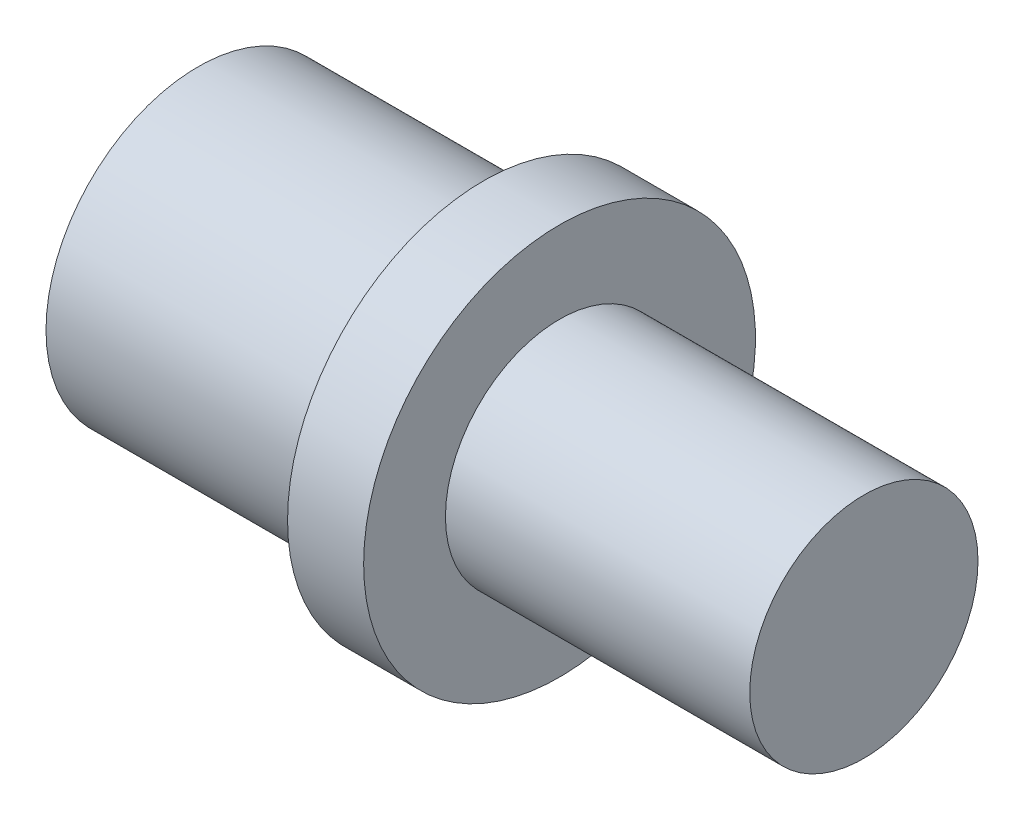
ISO-10303-21;
HEADER;
FILE_DESCRIPTION(('STEP AP214'),'2;1');
FILE_NAME('part.step','',(''),(''),'','','');
FILE_SCHEMA(('AUTOMOTIVE_DESIGN { 1 0 10303 214 1 1 1 1 }'));
ENDSEC;
DATA;
#1=APPLICATION_CONTEXT('core data for automotive mechanical design processes');
#2=APPLICATION_PROTOCOL_DEFINITION('international standard','automotive_design',2000,#1);
#3=PRODUCT_CONTEXT('',#1,'mechanical');
#4=PRODUCT('Part','Part','',(#3));
#5=PRODUCT_RELATED_PRODUCT_CATEGORY('part','',(#4));
#6=PRODUCT_DEFINITION_FORMATION('','',#4);
#7=PRODUCT_DEFINITION_CONTEXT('part definition',#1,'design');
#8=PRODUCT_DEFINITION('design','',#6,#7);
#9=PRODUCT_DEFINITION_SHAPE('','',#8);
#10=(LENGTH_UNIT() NAMED_UNIT(*) SI_UNIT(.MILLI.,.METRE.));
#11=(NAMED_UNIT(*) PLANE_ANGLE_UNIT() SI_UNIT($,.RADIAN.));
#12=(NAMED_UNIT(*) SI_UNIT($,.STERADIAN.) SOLID_ANGLE_UNIT());
#13=UNCERTAINTY_MEASURE_WITH_UNIT(LENGTH_MEASURE(1.E-05),#10,'distance_accuracy_value','');
#14=(GEOMETRIC_REPRESENTATION_CONTEXT(3) GLOBAL_UNCERTAINTY_ASSIGNED_CONTEXT((#13)) GLOBAL_UNIT_ASSIGNED_CONTEXT((#10,
#11,#12)) REPRESENTATION_CONTEXT('',''));
#15=CARTESIAN_POINT('',(0.,0.,0.));
#16=DIRECTION('',(0.,0.,1.));
#17=DIRECTION('',(1.,0.,0.));
#18=AXIS2_PLACEMENT_3D('',#15,#16,#17);
#19=CARTESIAN_POINT('',(-9.5,3.2,0.));
#20=DIRECTION('',(1.,0.,0.));
#21=DIRECTION('',(0.,0.,-1.));
#22=AXIS2_PLACEMENT_3D('',#19,#20,#21);
#23=PLANE('',#22);
#24=CARTESIAN_POINT('',(-9.5,0.,0.));
#25=DIRECTION('',(-1.,0.,0.));
#26=DIRECTION('',(0.,0.,1.));
#27=AXIS2_PLACEMENT_3D('',#24,#25,#26);
#28=CIRCLE('',#27,3.2);
#29=CARTESIAN_POINT('',(-9.5,0.,3.2));
#30=VERTEX_POINT('',#29);
#31=EDGE_CURVE('E150',#30,#30,#28,.T.);
#32=ORIENTED_EDGE('',*,*,#31,.T.);
#33=EDGE_LOOP('',(#32));
#34=FACE_BOUND('',#33,.T.);
#35=DIRECTION('',(0.,-1.,0.));
#36=VECTOR('',#35,1.);
#37=CARTESIAN_POINT('',(-9.5,1.44337567297406,2.5));
#38=LINE('',#37,#36);
#39=CARTESIAN_POINT('',(-9.5,1.44337567297406,2.5));
#40=VERTEX_POINT('',#39);
#41=CARTESIAN_POINT('',(-9.5,-1.44337567297406,2.5));
#42=VERTEX_POINT('',#41);
#43=EDGE_CURVE('E281',#40,#42,#38,.T.);
#44=ORIENTED_EDGE('',*,*,#43,.T.);
#45=DIRECTION('',(0.,-0.5,-0.866025403784439));
#46=VECTOR('',#45,1.);
#47=CARTESIAN_POINT('',(-9.5,-1.44337567297406,2.5));
#48=LINE('',#47,#46);
#49=CARTESIAN_POINT('',(-9.5,-2.88675134594813,0.));
#50=VERTEX_POINT('',#49);
#51=EDGE_CURVE('E283',#42,#50,#48,.T.);
#52=ORIENTED_EDGE('',*,*,#51,.T.);
#53=DIRECTION('',(0.,0.5,-0.866025403784439));
#54=VECTOR('',#53,1.);
#55=CARTESIAN_POINT('',(-9.5,-2.88675134594813,0.));
#56=LINE('',#55,#54);
#57=CARTESIAN_POINT('',(-9.5,-1.44337567297406,-2.5));
#58=VERTEX_POINT('',#57);
#59=EDGE_CURVE('E285',#50,#58,#56,.T.);
#60=ORIENTED_EDGE('',*,*,#59,.T.);
#61=DIRECTION('',(0.,1.,0.));
#62=VECTOR('',#61,1.);
#63=CARTESIAN_POINT('',(-9.5,-1.44337567297406,-2.5));
#64=LINE('',#63,#62);
#65=CARTESIAN_POINT('',(-9.5,1.44337567297407,-2.5));
#66=VERTEX_POINT('',#65);
#67=EDGE_CURVE('E122',#58,#66,#64,.T.);
#68=ORIENTED_EDGE('',*,*,#67,.T.);
#69=DIRECTION('',(0.,0.5,0.866025403784439));
#70=VECTOR('',#69,1.);
#71=CARTESIAN_POINT('',(-9.5,1.44337567297407,-2.5));
#72=LINE('',#71,#70);
#73=CARTESIAN_POINT('',(-9.5,2.88675134594813,0.));
#74=VERTEX_POINT('',#73);
#75=EDGE_CURVE('E278',#66,#74,#72,.T.);
#76=ORIENTED_EDGE('',*,*,#75,.T.);
#77=DIRECTION('',(0.,-0.5,0.866025403784439));
#78=VECTOR('',#77,1.);
#79=CARTESIAN_POINT('',(-9.5,2.88675134594813,0.));
#80=LINE('',#79,#78);
#81=EDGE_CURVE('E137',#74,#40,#80,.T.);
#82=ORIENTED_EDGE('',*,*,#81,.T.);
#83=EDGE_LOOP('',(#44,#52,#60,#68,#76,#82));
#84=FACE_BOUND('',#83,.T.);
#85=ADVANCED_FACE('F39',(#34,#84),#23,.F.);
#86=CARTESIAN_POINT('',(8.,0.,0.));
#87=DIRECTION('',(-1.,0.,0.));
#88=DIRECTION('',(0.,0.,1.));
#89=AXIS2_PLACEMENT_3D('',#86,#87,#88);
#90=PLANE('',#89);
#91=CARTESIAN_POINT('',(8.,0.,0.));
#92=DIRECTION('',(-1.,0.,0.));
#93=DIRECTION('',(0.,0.,1.));
#94=AXIS2_PLACEMENT_3D('',#91,#92,#93);
#95=CIRCLE('',#94,3.);
#96=CARTESIAN_POINT('',(8.,0.,3.));
#97=VERTEX_POINT('',#96);
#98=EDGE_CURVE('E11',#97,#97,#95,.T.);
#99=ORIENTED_EDGE('',*,*,#98,.F.);
#100=EDGE_LOOP('',(#99));
#101=FACE_BOUND('',#100,.T.);
#102=ADVANCED_FACE('F176',(#101),#90,.F.);
#103=CARTESIAN_POINT('',(-9.19047979429519,0.,0.));
#104=DIRECTION('',(-1.,0.,0.));
#105=DIRECTION('',(0.,0.,1.));
#106=AXIS2_PLACEMENT_3D('',#103,#104,#105);
#107=CYLINDRICAL_SURFACE('',#106,3.);
#108=CARTESIAN_POINT('',(0.,0.,0.));
#109=DIRECTION('',(-1.,0.,0.));
#110=DIRECTION('',(0.,0.,1.));
#111=AXIS2_PLACEMENT_3D('',#108,#109,#110);
#112=CIRCLE('',#111,3.);
#113=CARTESIAN_POINT('',(0.,0.,3.));
#114=VERTEX_POINT('',#113);
#115=EDGE_CURVE('E46',#114,#114,#112,.T.);
#116=ORIENTED_EDGE('',*,*,#115,.F.);
#117=EDGE_LOOP('',(#116));
#118=FACE_BOUND('',#117,.T.);
#119=ORIENTED_EDGE('',*,*,#98,.T.);
#120=EDGE_LOOP('',(#119));
#121=FACE_BOUND('',#120,.T.);
#122=ADVANCED_FACE('F173',(#118,#121),#107,.T.);
#123=CARTESIAN_POINT('',(0.,3.,0.));
#124=DIRECTION('',(-1.,0.,0.));
#125=DIRECTION('',(0.,0.,1.));
#126=AXIS2_PLACEMENT_3D('',#123,#124,#125);
#127=PLANE('',#126);
#128=CARTESIAN_POINT('',(0.,0.,0.));
#129=DIRECTION('',(-1.,0.,0.));
#130=DIRECTION('',(0.,0.,1.));
#131=AXIS2_PLACEMENT_3D('',#128,#129,#130);
#132=CIRCLE('',#131,5.15);
#133=CARTESIAN_POINT('',(0.,0.,5.15));
#134=VERTEX_POINT('',#133);
#135=EDGE_CURVE('E166',#134,#134,#132,.T.);
#136=ORIENTED_EDGE('',*,*,#135,.F.);
#137=EDGE_LOOP('',(#136));
#138=FACE_BOUND('',#137,.T.);
#139=ORIENTED_EDGE('',*,*,#115,.T.);
#140=EDGE_LOOP('',(#139));
#141=FACE_BOUND('',#140,.T.);
#142=ADVANCED_FACE('F171',(#138,#141),#127,.F.);
#143=CARTESIAN_POINT('',(-9.19047979429519,0.,0.));
#144=DIRECTION('',(-1.,0.,0.));
#145=DIRECTION('',(0.,0.,1.));
#146=AXIS2_PLACEMENT_3D('',#143,#144,#145);
#147=CYLINDRICAL_SURFACE('',#146,5.15);
#148=CARTESIAN_POINT('',(-2.,0.,0.));
#149=DIRECTION('',(-1.,0.,0.));
#150=DIRECTION('',(0.,0.,1.));
#151=AXIS2_PLACEMENT_3D('',#148,#149,#150);
#152=CIRCLE('',#151,5.15);
#153=CARTESIAN_POINT('',(-2.,0.,5.15));
#154=VERTEX_POINT('',#153);
#155=EDGE_CURVE('E163',#154,#154,#152,.T.);
#156=ORIENTED_EDGE('',*,*,#155,.F.);
#157=EDGE_LOOP('',(#156));
#158=FACE_BOUND('',#157,.T.);
#159=ORIENTED_EDGE('',*,*,#135,.T.);
#160=EDGE_LOOP('',(#159));
#161=FACE_BOUND('',#160,.T.);
#162=ADVANCED_FACE('F188',(#158,#161),#147,.T.);
#163=CARTESIAN_POINT('',(-2.,5.15,0.));
#164=DIRECTION('',(1.,0.,0.));
#165=DIRECTION('',(0.,0.,-1.));
#166=AXIS2_PLACEMENT_3D('',#163,#164,#165);
#167=PLANE('',#166);
#168=CARTESIAN_POINT('',(-2.,0.,0.));
#169=DIRECTION('',(-1.,0.,0.));
#170=DIRECTION('',(0.,0.,1.));
#171=AXIS2_PLACEMENT_3D('',#168,#169,#170);
#172=CIRCLE('',#171,4.);
#173=CARTESIAN_POINT('',(-2.,0.,4.));
#174=VERTEX_POINT('',#173);
#175=EDGE_CURVE('E160',#174,#174,#172,.T.);
#176=ORIENTED_EDGE('',*,*,#175,.F.);
#177=EDGE_LOOP('',(#176));
#178=FACE_BOUND('',#177,.T.);
#179=ORIENTED_EDGE('',*,*,#155,.T.);
#180=EDGE_LOOP('',(#179));
#181=FACE_BOUND('',#180,.T.);
#182=ADVANCED_FACE('F192',(#178,#181),#167,.F.);
#183=CARTESIAN_POINT('',(-9.19047979429519,0.,0.));
#184=DIRECTION('',(-1.,0.,0.));
#185=DIRECTION('',(0.,0.,1.));
#186=AXIS2_PLACEMENT_3D('',#183,#184,#185);
#187=CYLINDRICAL_SURFACE('',#186,4.);
#188=CARTESIAN_POINT('',(-9.5,0.,0.));
#189=DIRECTION('',(-1.,0.,0.));
#190=DIRECTION('',(0.,0.,1.));
#191=AXIS2_PLACEMENT_3D('',#188,#189,#190);
#192=CIRCLE('',#191,4.);
#193=CARTESIAN_POINT('',(-9.5,0.,4.));
#194=VERTEX_POINT('',#193);
#195=EDGE_CURVE('E157',#194,#194,#192,.T.);
#196=ORIENTED_EDGE('',*,*,#195,.F.);
#197=EDGE_LOOP('',(#196));
#198=FACE_BOUND('',#197,.T.);
#199=ORIENTED_EDGE('',*,*,#175,.T.);
#200=EDGE_LOOP('',(#199));
#201=FACE_BOUND('',#200,.T.);
#202=ADVANCED_FACE('F196',(#198,#201),#187,.T.);
#203=CARTESIAN_POINT('',(-9.5,0.,0.));
#204=DIRECTION('',(-1.,0.,0.));
#205=DIRECTION('',(0.,0.,1.));
#206=AXIS2_PLACEMENT_3D('',#203,#204,#205);
#207=CONICAL_SURFACE('',#206,4.,1.01219701145133);
#208=CARTESIAN_POINT('',(-9.,0.,0.));
#209=DIRECTION('',(-1.,0.,0.));
#210=DIRECTION('',(0.,0.,1.));
#211=AXIS2_PLACEMENT_3D('',#208,#209,#210);
#212=CIRCLE('',#211,3.2);
#213=CARTESIAN_POINT('',(-9.,0.,3.2));
#214=VERTEX_POINT('',#213);
#215=EDGE_CURVE('E154',#214,#214,#212,.T.);
#216=ORIENTED_EDGE('',*,*,#215,.F.);
#217=EDGE_LOOP('',(#216));
#218=FACE_BOUND('',#217,.T.);
#219=ORIENTED_EDGE('',*,*,#195,.T.);
#220=EDGE_LOOP('',(#219));
#221=FACE_BOUND('',#220,.T.);
#222=ADVANCED_FACE('F200',(#218,#221),#207,.F.);
#223=CARTESIAN_POINT('',(-9.19047979429519,0.,0.));
#224=DIRECTION('',(-1.,0.,0.));
#225=DIRECTION('',(0.,0.,1.));
#226=AXIS2_PLACEMENT_3D('',#223,#224,#225);
#227=CYLINDRICAL_SURFACE('',#226,3.2);
#228=ORIENTED_EDGE('',*,*,#31,.F.);
#229=EDGE_LOOP('',(#228));
#230=FACE_BOUND('',#229,.T.);
#231=ORIENTED_EDGE('',*,*,#215,.T.);
#232=EDGE_LOOP('',(#231));
#233=FACE_BOUND('',#232,.T.);
#234=ADVANCED_FACE('F204',(#230,#233),#227,.T.);
#235=CARTESIAN_POINT('',(-7.,1.44337567297407,-2.5));
#236=DIRECTION('',(0.,-0.866025403784439,0.5));
#237=DIRECTION('',(0.,-0.5,-0.866025403784439));
#238=AXIS2_PLACEMENT_3D('',#235,#236,#237);
#239=PLANE('',#238);
#240=DIRECTION('',(0.,0.5,0.866025403784439));
#241=VECTOR('',#240,1.);
#242=CARTESIAN_POINT('',(-7.,1.44337567297407,-2.5));
#243=LINE('',#242,#241);
#244=CARTESIAN_POINT('',(-7.,1.44337567297407,-2.5));
#245=VERTEX_POINT('',#244);
#246=CARTESIAN_POINT('',(-7.,2.1650635094611,-1.25));
#247=VERTEX_POINT('',#246);
#248=EDGE_CURVE('E119',#245,#247,#243,.T.);
#249=ORIENTED_EDGE('',*,*,#248,.T.);
#250=CARTESIAN_POINT('',(-7.,2.88675134594813,0.));
#251=VERTEX_POINT('',#250);
#252=EDGE_CURVE('E111',#247,#251,#243,.T.);
#253=ORIENTED_EDGE('',*,*,#252,.T.);
#254=DIRECTION('',(-1.,0.,0.));
#255=VECTOR('',#254,1.);
#256=CARTESIAN_POINT('',(-7.,2.88675134594813,0.));
#257=LINE('',#256,#255);
#258=EDGE_CURVE('E116',#251,#74,#257,.T.);
#259=ORIENTED_EDGE('',*,*,#258,.T.);
#260=ORIENTED_EDGE('',*,*,#75,.F.);
#261=DIRECTION('',(-1.,0.,0.));
#262=VECTOR('',#261,1.);
#263=CARTESIAN_POINT('',(-7.,1.44337567297407,-2.5));
#264=LINE('',#263,#262);
#265=EDGE_CURVE('E277',#245,#66,#264,.T.);
#266=ORIENTED_EDGE('',*,*,#265,.F.);
#267=EDGE_LOOP('',(#249,#253,#259,#260,#266));
#268=FACE_BOUND('',#267,.T.);
#269=ADVANCED_FACE('F113',(#268),#239,.T.);
#270=CARTESIAN_POINT('',(-7.,2.88675134594813,0.));
#271=DIRECTION('',(0.,-0.866025403784439,-0.5));
#272=DIRECTION('',(0.,0.5,-0.866025403784439));
#273=AXIS2_PLACEMENT_3D('',#270,#271,#272);
#274=PLANE('',#273);
#275=DIRECTION('',(0.,-0.5,0.866025403784439));
#276=VECTOR('',#275,1.);
#277=CARTESIAN_POINT('',(-7.,2.88675134594813,0.));
#278=LINE('',#277,#276);
#279=CARTESIAN_POINT('',(-7.,2.1650635094611,1.25));
#280=VERTEX_POINT('',#279);
#281=EDGE_CURVE('E125',#251,#280,#278,.T.);
#282=ORIENTED_EDGE('',*,*,#281,.T.);
#283=CARTESIAN_POINT('',(-7.,1.44337567297406,2.5));
#284=VERTEX_POINT('',#283);
#285=EDGE_CURVE('E132',#280,#284,#278,.T.);
#286=ORIENTED_EDGE('',*,*,#285,.T.);
#287=DIRECTION('',(-1.,0.,0.));
#288=VECTOR('',#287,1.);
#289=CARTESIAN_POINT('',(-7.,1.44337567297406,2.5));
#290=LINE('',#289,#288);
#291=EDGE_CURVE('E139',#284,#40,#290,.T.);
#292=ORIENTED_EDGE('',*,*,#291,.T.);
#293=ORIENTED_EDGE('',*,*,#81,.F.);
#294=ORIENTED_EDGE('',*,*,#258,.F.);
#295=EDGE_LOOP('',(#282,#286,#292,#293,#294));
#296=FACE_BOUND('',#295,.T.);
#297=ADVANCED_FACE('F135',(#296),#274,.T.);
#298=CARTESIAN_POINT('',(-7.,1.44337567297406,2.5));
#299=DIRECTION('',(0.,0.,-1.));
#300=DIRECTION('',(0.,1.,0.));
#301=AXIS2_PLACEMENT_3D('',#298,#299,#300);
#302=PLANE('',#301);
#303=DIRECTION('',(0.,-1.,0.));
#304=VECTOR('',#303,1.);
#305=CARTESIAN_POINT('',(-7.,1.44337567297406,2.5));
#306=LINE('',#305,#304);
#307=CARTESIAN_POINT('',(-7.,0.,2.5));
#308=VERTEX_POINT('',#307);
#309=EDGE_CURVE('E266',#284,#308,#306,.T.);
#310=ORIENTED_EDGE('',*,*,#309,.T.);
#311=CARTESIAN_POINT('',(-7.,-1.44337567297406,2.5));
#312=VERTEX_POINT('',#311);
#313=EDGE_CURVE('E131',#308,#312,#306,.T.);
#314=ORIENTED_EDGE('',*,*,#313,.T.);
#315=DIRECTION('',(-1.,0.,0.));
#316=VECTOR('',#315,1.);
#317=CARTESIAN_POINT('',(-7.,-1.44337567297406,2.5));
#318=LINE('',#317,#316);
#319=EDGE_CURVE('E145',#312,#42,#318,.T.);
#320=ORIENTED_EDGE('',*,*,#319,.T.);
#321=ORIENTED_EDGE('',*,*,#43,.F.);
#322=ORIENTED_EDGE('',*,*,#291,.F.);
#323=EDGE_LOOP('',(#310,#314,#320,#321,#322));
#324=FACE_BOUND('',#323,.T.);
#325=ADVANCED_FACE('F218',(#324),#302,.T.);
#326=CARTESIAN_POINT('',(-7.,-1.44337567297406,2.5));
#327=DIRECTION('',(0.,0.866025403784438,-0.5));
#328=DIRECTION('',(0.,0.5,0.866025403784439));
#329=AXIS2_PLACEMENT_3D('',#326,#327,#328);
#330=PLANE('',#329);
#331=DIRECTION('',(0.,-0.5,-0.866025403784439));
#332=VECTOR('',#331,1.);
#333=CARTESIAN_POINT('',(-7.,-1.44337567297406,2.5));
#334=LINE('',#333,#332);
#335=CARTESIAN_POINT('',(-7.,-2.1650635094611,1.25));
#336=VERTEX_POINT('',#335);
#337=EDGE_CURVE('E260',#312,#336,#334,.T.);
#338=ORIENTED_EDGE('',*,*,#337,.T.);
#339=CARTESIAN_POINT('',(-7.,-2.88675134594813,0.));
#340=VERTEX_POINT('',#339);
#341=EDGE_CURVE('E263',#336,#340,#334,.T.);
#342=ORIENTED_EDGE('',*,*,#341,.T.);
#343=DIRECTION('',(-1.,0.,0.));
#344=VECTOR('',#343,1.);
#345=CARTESIAN_POINT('',(-7.,-2.88675134594813,0.));
#346=LINE('',#345,#344);
#347=EDGE_CURVE('E292',#340,#50,#346,.T.);
#348=ORIENTED_EDGE('',*,*,#347,.T.);
#349=ORIENTED_EDGE('',*,*,#51,.F.);
#350=ORIENTED_EDGE('',*,*,#319,.F.);
#351=EDGE_LOOP('',(#338,#342,#348,#349,#350));
#352=FACE_BOUND('',#351,.T.);
#353=ADVANCED_FACE('F221',(#352),#330,.T.);
#354=CARTESIAN_POINT('',(-7.,-2.88675134594813,0.));
#355=DIRECTION('',(0.,0.866025403784439,0.5));
#356=DIRECTION('',(0.,-0.5,0.866025403784439));
#357=AXIS2_PLACEMENT_3D('',#354,#355,#356);
#358=PLANE('',#357);
#359=DIRECTION('',(0.,0.5,-0.866025403784439));
#360=VECTOR('',#359,1.);
#361=CARTESIAN_POINT('',(-7.,-2.88675134594813,0.));
#362=LINE('',#361,#360);
#363=CARTESIAN_POINT('',(-7.,-2.1650635094611,-1.25));
#364=VERTEX_POINT('',#363);
#365=EDGE_CURVE('E53',#340,#364,#362,.T.);
#366=ORIENTED_EDGE('',*,*,#365,.T.);
#367=CARTESIAN_POINT('',(-7.,-1.44337567297406,-2.5));
#368=VERTEX_POINT('',#367);
#369=EDGE_CURVE('E257',#364,#368,#362,.T.);
#370=ORIENTED_EDGE('',*,*,#369,.T.);
#371=DIRECTION('',(-1.,0.,0.));
#372=VECTOR('',#371,1.);
#373=CARTESIAN_POINT('',(-7.,-1.44337567297406,-2.5));
#374=LINE('',#373,#372);
#375=EDGE_CURVE('E290',#368,#58,#374,.T.);
#376=ORIENTED_EDGE('',*,*,#375,.T.);
#377=ORIENTED_EDGE('',*,*,#59,.F.);
#378=ORIENTED_EDGE('',*,*,#347,.F.);
#379=EDGE_LOOP('',(#366,#370,#376,#377,#378));
#380=FACE_BOUND('',#379,.T.);
#381=ADVANCED_FACE('F225',(#380),#358,.T.);
#382=CARTESIAN_POINT('',(-7.,-1.44337567297406,-2.5));
#383=DIRECTION('',(0.,0.,1.));
#384=DIRECTION('',(0.,-1.,0.));
#385=AXIS2_PLACEMENT_3D('',#382,#383,#384);
#386=PLANE('',#385);
#387=DIRECTION('',(0.,1.,0.));
#388=VECTOR('',#387,1.);
#389=CARTESIAN_POINT('',(-7.,-1.44337567297406,-2.5));
#390=LINE('',#389,#388);
#391=CARTESIAN_POINT('',(-7.,0.,-2.5));
#392=VERTEX_POINT('',#391);
#393=EDGE_CURVE('E256',#368,#392,#390,.T.);
#394=ORIENTED_EDGE('',*,*,#393,.T.);
#395=EDGE_CURVE('E251',#392,#245,#390,.T.);
#396=ORIENTED_EDGE('',*,*,#395,.T.);
#397=ORIENTED_EDGE('',*,*,#265,.T.);
#398=ORIENTED_EDGE('',*,*,#67,.F.);
#399=ORIENTED_EDGE('',*,*,#375,.F.);
#400=EDGE_LOOP('',(#394,#396,#397,#398,#399));
#401=FACE_BOUND('',#400,.T.);
#402=ADVANCED_FACE('F229',(#401),#386,.T.);
#403=CARTESIAN_POINT('',(-7.,0.,0.));
#404=DIRECTION('',(1.,0.,0.));
#405=DIRECTION('',(0.,0.,-1.));
#406=AXIS2_PLACEMENT_3D('',#403,#404,#405);
#407=PLANE('',#406);
#408=CARTESIAN_POINT('',(-7.,0.,0.));
#409=DIRECTION('',(-1.,0.,0.));
#410=DIRECTION('',(0.,-1.,0.));
#411=AXIS2_PLACEMENT_3D('',#408,#409,#410);
#412=CIRCLE('',#411,2.5);
#413=EDGE_CURVE('E250',#247,#392,#412,.T.);
#414=ORIENTED_EDGE('',*,*,#413,.F.);
#415=ORIENTED_EDGE('',*,*,#248,.F.);
#416=ORIENTED_EDGE('',*,*,#395,.F.);
#417=EDGE_LOOP('',(#414,#415,#416));
#418=FACE_BOUND('',#417,.T.);
#419=ADVANCED_FACE('F232',(#418),#407,.F.);
#420=EDGE_CURVE('E127',#280,#247,#412,.T.);
#421=ORIENTED_EDGE('',*,*,#420,.F.);
#422=ORIENTED_EDGE('',*,*,#281,.F.);
#423=ORIENTED_EDGE('',*,*,#252,.F.);
#424=EDGE_LOOP('',(#421,#422,#423));
#425=FACE_BOUND('',#424,.T.);
#426=ADVANCED_FACE('F126',(#425),#407,.F.);
#427=EDGE_CURVE('E151',#308,#280,#412,.T.);
#428=ORIENTED_EDGE('',*,*,#427,.F.);
#429=ORIENTED_EDGE('',*,*,#309,.F.);
#430=ORIENTED_EDGE('',*,*,#285,.F.);
#431=EDGE_LOOP('',(#428,#429,#430));
#432=FACE_BOUND('',#431,.T.);
#433=ADVANCED_FACE('F247',(#432),#407,.F.);
#434=EDGE_CURVE('E144',#336,#308,#412,.T.);
#435=ORIENTED_EDGE('',*,*,#434,.F.);
#436=ORIENTED_EDGE('',*,*,#337,.F.);
#437=ORIENTED_EDGE('',*,*,#313,.F.);
#438=EDGE_LOOP('',(#435,#436,#437));
#439=FACE_BOUND('',#438,.T.);
#440=ADVANCED_FACE('F240',(#439),#407,.F.);
#441=EDGE_CURVE('E138',#364,#336,#412,.T.);
#442=ORIENTED_EDGE('',*,*,#441,.F.);
#443=ORIENTED_EDGE('',*,*,#365,.F.);
#444=ORIENTED_EDGE('',*,*,#341,.F.);
#445=EDGE_LOOP('',(#442,#443,#444));
#446=FACE_BOUND('',#445,.T.);
#447=ADVANCED_FACE('F235',(#446),#407,.F.);
#448=EDGE_CURVE('E142',#392,#364,#412,.T.);
#449=ORIENTED_EDGE('',*,*,#448,.F.);
#450=ORIENTED_EDGE('',*,*,#393,.F.);
#451=ORIENTED_EDGE('',*,*,#369,.F.);
#452=EDGE_LOOP('',(#449,#450,#451));
#453=FACE_BOUND('',#452,.T.);
#454=ADVANCED_FACE('F212',(#453),#407,.F.);
#455=CARTESIAN_POINT('',(-5.49784845243109,0.,0.));
#456=DIRECTION('',(-1.,0.,0.));
#457=DIRECTION('',(0.,-1.,0.));
#458=AXIS2_PLACEMENT_3D('',#455,#456,#457);
#459=CONICAL_SURFACE('',#458,0.,1.02974425867665);
#460=ORIENTED_EDGE('',*,*,#434,.T.);
#461=ORIENTED_EDGE('',*,*,#427,.T.);
#462=ORIENTED_EDGE('',*,*,#420,.T.);
#463=ORIENTED_EDGE('',*,*,#413,.T.);
#464=ORIENTED_EDGE('',*,*,#448,.T.);
#465=ORIENTED_EDGE('',*,*,#441,.T.);
#466=EDGE_LOOP('',(#460,#461,#462,#463,#464,#465));
#467=FACE_BOUND('',#466,.T.);
#468=CARTESIAN_POINT('',(-5.49784845243109,0.,0.));
#469=VERTEX_POINT('',#468);
#470=VERTEX_LOOP('',#469);
#471=FACE_BOUND('',#470,.T.);
#472=ADVANCED_FACE('F209',(#467,#471),#459,.F.);
#473=CLOSED_SHELL('',(#85,#102,#122,#142,#162,#182,#202,#222,#234,#269,#297,#325,#353,#381,#402,
#419,#426,#433,#440,#447,#454,#472));
#474=MANIFOLD_SOLID_BREP('B2',#473);
#475=ADVANCED_BREP_SHAPE_REPRESENTATION('',(#18,#474),#14);
#476=SHAPE_DEFINITION_REPRESENTATION(#9,#475);
ENDSEC;
END-ISO-10303-21;
